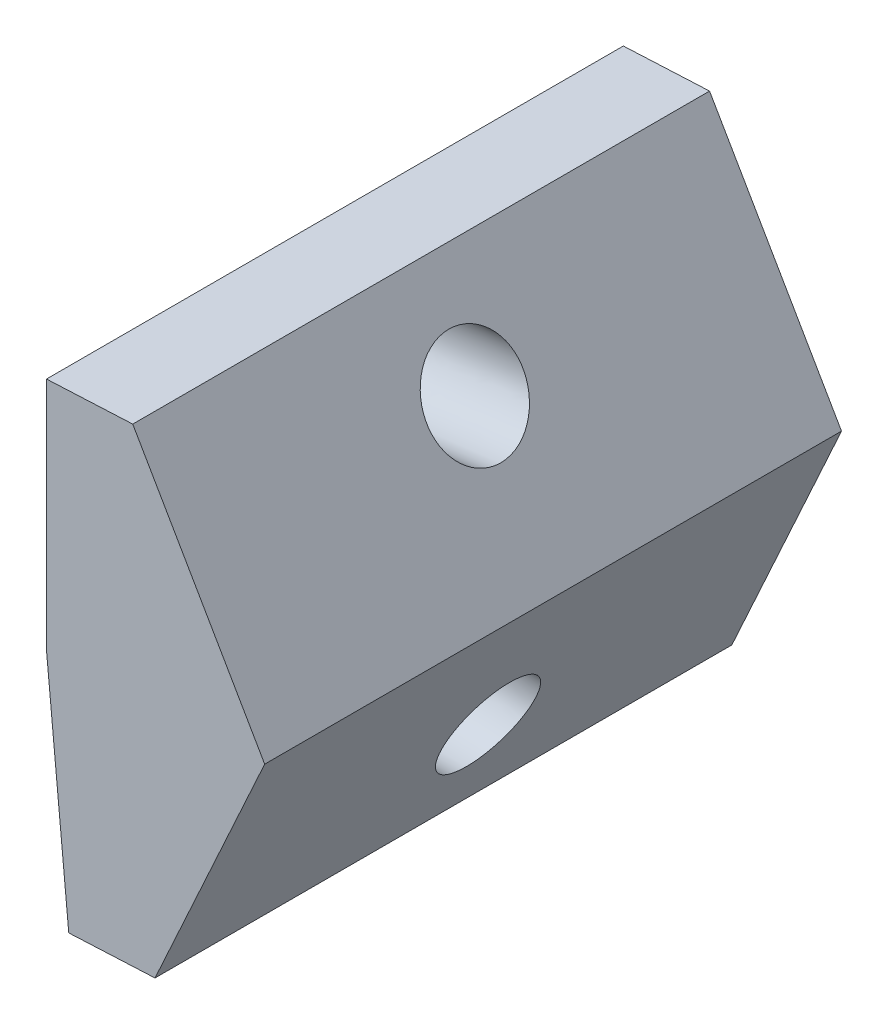
ISO-10303-21;
HEADER;
FILE_DESCRIPTION(('STEP AP214'),'2;1');
FILE_NAME('part.step','',(''),(''),'','','');
FILE_SCHEMA(('AUTOMOTIVE_DESIGN { 1 0 10303 214 1 1 1 1 }'));
ENDSEC;
DATA;
#1=APPLICATION_CONTEXT('core data for automotive mechanical design processes');
#2=APPLICATION_PROTOCOL_DEFINITION('international standard','automotive_design',2000,#1);
#3=PRODUCT_CONTEXT('',#1,'mechanical');
#4=PRODUCT('Part','Part','',(#3));
#5=PRODUCT_RELATED_PRODUCT_CATEGORY('part','',(#4));
#6=PRODUCT_DEFINITION_FORMATION('','',#4);
#7=PRODUCT_DEFINITION_CONTEXT('part definition',#1,'design');
#8=PRODUCT_DEFINITION('design','',#6,#7);
#9=PRODUCT_DEFINITION_SHAPE('','',#8);
#10=(LENGTH_UNIT() NAMED_UNIT(*) SI_UNIT(.MILLI.,.METRE.));
#11=(NAMED_UNIT(*) PLANE_ANGLE_UNIT() SI_UNIT($,.RADIAN.));
#12=(NAMED_UNIT(*) SI_UNIT($,.STERADIAN.) SOLID_ANGLE_UNIT());
#13=UNCERTAINTY_MEASURE_WITH_UNIT(LENGTH_MEASURE(1.E-05),#10,'distance_accuracy_value','');
#14=(GEOMETRIC_REPRESENTATION_CONTEXT(3) GLOBAL_UNCERTAINTY_ASSIGNED_CONTEXT((#13)) GLOBAL_UNIT_ASSIGNED_CONTEXT((#10,
#11,#12)) REPRESENTATION_CONTEXT('',''));
#15=CARTESIAN_POINT('',(0.,0.,0.));
#16=DIRECTION('',(0.,0.,1.));
#17=DIRECTION('',(1.,0.,0.));
#18=AXIS2_PLACEMENT_3D('',#15,#16,#17);
#19=CARTESIAN_POINT('',(-3.5303,-10.0970811615136,7.5));
#20=DIRECTION('',(1.,0.,0.));
#21=DIRECTION('',(0.,1.,0.));
#22=AXIS2_PLACEMENT_3D('',#19,#20,#21);
#23=PLANE('',#22);
#24=DIRECTION('',(0.,-1.,0.));
#25=VECTOR('',#24,1.);
#26=CARTESIAN_POINT('',(-3.5303,-10.0970811615136,-7.5));
#27=LINE('',#26,#25);
#28=CARTESIAN_POINT('',(-3.5303,-3.99106819498268,-7.5));
#29=VERTEX_POINT('',#28);
#30=CARTESIAN_POINT('',(-3.5303,-10.0970811615136,-7.5));
#31=VERTEX_POINT('',#30);
#32=EDGE_CURVE('E143',#29,#31,#27,.T.);
#33=ORIENTED_EDGE('',*,*,#32,.T.);
#34=DIRECTION('',(0.,0.,-1.));
#35=VECTOR('',#34,1.);
#36=CARTESIAN_POINT('',(-3.5303,-10.0970811615136,7.5));
#37=LINE('',#36,#35);
#38=CARTESIAN_POINT('',(-3.5303,-10.0970811615136,7.5));
#39=VERTEX_POINT('',#38);
#40=EDGE_CURVE('E140',#39,#31,#37,.T.);
#41=ORIENTED_EDGE('',*,*,#40,.F.);
#42=DIRECTION('',(0.,-1.,0.));
#43=VECTOR('',#42,1.);
#44=CARTESIAN_POINT('',(-3.5303,-10.0970811615136,7.5));
#45=LINE('',#44,#43);
#46=CARTESIAN_POINT('',(-3.5303,-3.99106819498268,7.5));
#47=VERTEX_POINT('',#46);
#48=EDGE_CURVE('E85',#47,#39,#45,.T.);
#49=ORIENTED_EDGE('',*,*,#48,.F.);
#50=DIRECTION('',(0.,0.,-1.));
#51=VECTOR('',#50,1.);
#52=CARTESIAN_POINT('',(-3.5303,-3.99106819498268,7.5));
#53=LINE('',#52,#51);
#54=EDGE_CURVE('E52',#47,#29,#53,.T.);
#55=ORIENTED_EDGE('',*,*,#54,.T.);
#56=EDGE_LOOP('',(#33,#41,#49,#55));
#57=FACE_BOUND('',#56,.T.);
#58=CARTESIAN_POINT('',(-3.5303,-7.9918073271231,0.));
#59=CARTESIAN_POINT('',(-3.5303,-7.99180394474288,0.0692361131438415));
#60=CARTESIAN_POINT('',(-3.5303,-7.98603376199412,0.138544909012275));
#61=CARTESIAN_POINT('',(-3.5303,-7.96310415475466,0.275212768795426));
#62=CARTESIAN_POINT('',(-3.53029999999999,-7.94594473024024,0.342571832706082));
#63=CARTESIAN_POINT('',(-3.5303,-7.90071388855061,0.473531497229015));
#64=CARTESIAN_POINT('',(-3.53030000000001,-7.8726424773822,0.537132099910216));
#65=CARTESIAN_POINT('',(-3.53030000000001,-7.80636086950595,0.658807459460621));
#66=CARTESIAN_POINT('',(-3.5303,-7.76815068205695,0.716882221376018));
#67=CARTESIAN_POINT('',(-3.53029999999999,-7.68264571859224,0.825907649897007));
#68=CARTESIAN_POINT('',(-3.53029999999999,-7.63535095216627,0.876858324022741));
#69=CARTESIAN_POINT('',(-3.5303,-7.53298122858287,0.970229355897886));
#70=CARTESIAN_POINT('',(-3.53029999999999,-7.4779062798463,1.01264972287993));
#71=CARTESIAN_POINT('',(-3.53029999999999,-7.36149526560176,1.087790404585));
#72=CARTESIAN_POINT('',(-3.5303,-7.30015920629542,1.12051072891578));
#73=CARTESIAN_POINT('',(-3.53029999999999,-7.17291769740442,1.17534881186071));
#74=CARTESIAN_POINT('',(-3.53029999999999,-7.10701225143016,1.19746657885212));
#75=CARTESIAN_POINT('',(-3.5303,-6.97244972088646,1.2304895500749));
#76=CARTESIAN_POINT('',(-3.5303,-6.90379263770161,1.24139475994819));
#77=CARTESIAN_POINT('',(-3.5303,-6.76562046752682,1.25169184641547));
#78=CARTESIAN_POINT('',(-3.53030000000001,-6.69610538067511,1.25108372486434));
#79=CARTESIAN_POINT('',(-3.53030000000001,-6.55813451319878,1.23837092738207));
#80=CARTESIAN_POINT('',(-3.53030000000001,-6.48967873257312,1.22626625146212));
#81=CARTESIAN_POINT('',(-3.53030000000001,-6.35571457978345,1.1908942126054));
#82=CARTESIAN_POINT('',(-3.53030000000001,-6.29020620760946,1.16762684970642));
#83=CARTESIAN_POINT('',(-3.53030000000001,-6.16394367648924,1.11057118936071));
#84=CARTESIAN_POINT('',(-3.5303,-6.10318951751723,1.07678289197105));
#85=CARTESIAN_POINT('',(-3.5303,-5.9881110845989,0.999617296648222));
#86=CARTESIAN_POINT('',(-3.53029999999999,-5.93378681060842,0.956239998780942));
#87=CARTESIAN_POINT('',(-3.53029999999999,-5.83306646933222,0.861092811173564));
#88=CARTESIAN_POINT('',(-3.5303,-5.78667040198655,0.809322921496942));
#89=CARTESIAN_POINT('',(-3.5303,-5.70308612146547,0.698818432336043));
#90=CARTESIAN_POINT('',(-3.5303,-5.66589790822167,0.640083832903495));
#91=CARTESIAN_POINT('',(-3.5303,-5.60175501756303,0.517269895172356));
#92=CARTESIAN_POINT('',(-3.53030000000001,-5.57480034008189,0.453190556908385));
#93=CARTESIAN_POINT('',(-3.53030000000001,-5.53186795045755,0.321454520228471));
#94=CARTESIAN_POINT('',(-3.5303,-5.51589023826147,0.253797821829763));
#95=CARTESIAN_POINT('',(-3.53029999999999,-5.49535245487502,0.116773106148691));
#96=CARTESIAN_POINT('',(-3.53029999999999,-5.49079238365462,0.0474050888708287));
#97=CARTESIAN_POINT('',(-3.5303,-5.49321565174281,-0.0911290259163035));
#98=CARTESIAN_POINT('',(-3.5303,-5.50019899104962,-0.160295123425605));
#99=CARTESIAN_POINT('',(-3.5303,-5.52551647533157,-0.296517728885802));
#100=CARTESIAN_POINT('',(-3.53030000000001,-5.54385062033325,-0.363574236831768));
#101=CARTESIAN_POINT('',(-3.53030000000001,-5.59136404808877,-0.49372817496707));
#102=CARTESIAN_POINT('',(-3.53030000000001,-5.62054333089221,-0.556825605138298));
#103=CARTESIAN_POINT('',(-3.53030000000001,-5.68894224791223,-0.677321089950941));
#104=CARTESIAN_POINT('',(-3.5303,-5.72816188219214,-0.734719144556398));
#105=CARTESIAN_POINT('',(-3.5303,-5.81555979128732,-0.842232769485394));
#106=CARTESIAN_POINT('',(-3.5303,-5.86373806616845,-0.892348339755383));
#107=CARTESIAN_POINT('',(-3.5303,-5.96772445279868,-0.983914740995391));
#108=CARTESIAN_POINT('',(-3.53030000000001,-6.02353256460571,-1.02536557189963));
#109=CARTESIAN_POINT('',(-3.53030000000001,-6.14123937621127,-1.09845921944958));
#110=CARTESIAN_POINT('',(-3.5303,-6.20313807605243,-1.13010203602665));
#111=CARTESIAN_POINT('',(-3.5303,-6.33131882283796,-1.18270689590419));
#112=CARTESIAN_POINT('',(-3.5303,-6.39760086980704,-1.20366893914443));
#113=CARTESIAN_POINT('',(-3.53029999999999,-6.53272016616868,-1.23433408408164));
#114=CARTESIAN_POINT('',(-3.53029999999999,-6.60155741557058,-1.2440371857374));
#115=CARTESIAN_POINT('',(-3.5303,-6.73988849251748,-1.25191681931931));
#116=CARTESIAN_POINT('',(-3.5303,-6.80938232006331,-1.25009335123069));
#117=CARTESIAN_POINT('',(-3.5303,-6.94710981905069,-1.23497013917212));
#118=CARTESIAN_POINT('',(-3.5303,-7.0153434904938,-1.22167039521637));
#119=CARTESIAN_POINT('',(-3.53029999999999,-7.14866870039823,-1.18396146308635));
#120=CARTESIAN_POINT('',(-3.53029999999999,-7.21376023887092,-1.15955227495232));
#121=CARTESIAN_POINT('',(-3.53029999999999,-7.33900587920801,-1.10029769267066));
#122=CARTESIAN_POINT('',(-3.53029999999999,-7.39915998110008,-1.06545229858158));
#123=CARTESIAN_POINT('',(-3.5303,-7.51287161335104,-0.986286422007295));
#124=CARTESIAN_POINT('',(-3.5303,-7.56642914375599,-0.941965939588243));
#125=CARTESIAN_POINT('',(-3.5303,-7.66547051224383,-0.84507220583463));
#126=CARTESIAN_POINT('',(-3.5303,-7.710954350388,-0.792498954562694));
#127=CARTESIAN_POINT('',(-3.53029999999999,-7.79259365136215,-0.6805501066953));
#128=CARTESIAN_POINT('',(-3.53029999999999,-7.82874911426083,-0.621174510149938));
#129=CARTESIAN_POINT('',(-3.5303,-7.89073520009994,-0.497257186717971));
#130=CARTESIAN_POINT('',(-3.5303,-7.91656582310576,-0.432715459864088));
#131=CARTESIAN_POINT('',(-3.5303,-7.95485305428998,-0.307862479443491));
#132=CARTESIAN_POINT('',(-3.5303,-7.96850543917982,-0.247917394010153));
#133=CARTESIAN_POINT('',(-3.5303,-7.98237526806179,-0.156429210434266));
#134=CARTESIAN_POINT('',(-3.5303,-7.98589788710458,-0.125357540837874));
#135=CARTESIAN_POINT('',(-3.5303,-7.99062133412572,-0.0628629049591802));
#136=CARTESIAN_POINT('',(-3.5303,-7.99180886300465,-0.0314389457567166));
#137=CARTESIAN_POINT('',(-3.5303,-7.9918073271231,0.));
#138=B_SPLINE_CURVE_WITH_KNOTS('',3,(#58,#59,#60,#61,#62,#63,#64,#65,#66,#67,#68,#69,#70,#71,
#72,#73,#74,#75,#76,#77,#78,#79,#80,#81,#82,#83,#84,#85,#86,#87,#88,#89,#90,#91,#92,#93,#94,#95,
#96,#97,#98,#99,#100,#101,#102,#103,#104,#105,#106,#107,#108,#109,#110,#111,#112,#113,#114,#115,
#116,#117,#118,#119,#120,#121,#122,#123,#124,#125,#126,#127,#128,#129,#130,#131,#132,#133,#134,
#135,#136,#137),.UNSPECIFIED.,.T.,.F.,(4,2,2,2,2,2,2,2,2,2,2,2,2,2,2,2,2,2,2,2,2,2,2,2,2,2,2,2,
2,2,2,2,2,2,2,2,2,2,2,4),(0.,0.207595797918636,0.415191596269628,0.622787280344089,
0.830382774840533,1.03797805019884,1.24557310086877,1.45316794591798,1.66076262694274,
1.86835720351039,2.07595174663294,2.28354628955317,2.49114083177063,2.69873537286185,
2.90632991252679,3.11392445062165,3.32151898717466,3.529113522383,3.73670805659115,
3.94430259025319,4.15189712388303,4.35949165799809,4.56708619306266,4.77468072943697,
4.98227526733777,5.18986980681455,5.39746434774416,5.60505888984422,5.81265343270415,
6.02024797583011,6.22784251869907,6.43543706081622,6.64303160176907,6.85062614127274,
7.0582206792011,7.26581521560063,7.47340975068532,7.657148364809,7.75088178520914,
7.84514751928525),.UNSPECIFIED.);
#139=CARTESIAN_POINT('',(-3.5303,-7.9918073271231,0.));
#140=VERTEX_POINT('',#139);
#141=EDGE_CURVE('E158',#140,#140,#138,.T.);
#142=ORIENTED_EDGE('',*,*,#141,.F.);
#143=EDGE_LOOP('',(#142));
#144=FACE_BOUND('',#143,.T.);
#145=ADVANCED_FACE('F38',(#57,#144),#23,.F.);
#146=CARTESIAN_POINT('',(-1.28768671203867,-3.88432015647812,7.5));
#147=DIRECTION('',(-0.866025403784439,-0.5,0.));
#148=DIRECTION('',(0.5,-0.866025403784439,0.));
#149=AXIS2_PLACEMENT_3D('',#146,#147,#148);
#150=PLANE('',#149);
#151=DIRECTION('',(-0.5,0.866025403784439,0.));
#152=VECTOR('',#151,1.);
#153=CARTESIAN_POINT('',(-1.28768671203867,-3.88432015647812,-7.5));
#154=LINE('',#153,#152);
#155=CARTESIAN_POINT('',(2.14350896906507,-9.8273254068607,-7.5));
#156=VERTEX_POINT('',#155);
#157=CARTESIAN_POINT('',(-1.28768671203867,-3.88432015647812,-7.5));
#158=VERTEX_POINT('',#157);
#159=EDGE_CURVE('E75',#156,#158,#154,.T.);
#160=ORIENTED_EDGE('',*,*,#159,.T.);
#161=DIRECTION('',(0.,0.,-1.));
#162=VECTOR('',#161,1.);
#163=CARTESIAN_POINT('',(-1.28768671203867,-3.88432015647812,7.5));
#164=LINE('',#163,#162);
#165=CARTESIAN_POINT('',(-1.28768671203867,-3.88432015647812,7.5));
#166=VERTEX_POINT('',#165);
#167=EDGE_CURVE('E11',#166,#158,#164,.T.);
#168=ORIENTED_EDGE('',*,*,#167,.F.);
#169=DIRECTION('',(-0.5,0.866025403784439,0.));
#170=VECTOR('',#169,1.);
#171=CARTESIAN_POINT('',(-1.28768671203867,-3.88432015647812,7.5));
#172=LINE('',#171,#170);
#173=CARTESIAN_POINT('',(2.14350896906507,-9.8273254068607,7.5));
#174=VERTEX_POINT('',#173);
#175=EDGE_CURVE('E145',#174,#166,#172,.T.);
#176=ORIENTED_EDGE('',*,*,#175,.F.);
#177=DIRECTION('',(0.,0.,-1.));
#178=VECTOR('',#177,1.);
#179=CARTESIAN_POINT('',(2.14350896906507,-9.82732540686069,7.5));
#180=LINE('',#179,#178);
#181=EDGE_CURVE('E123',#174,#156,#180,.T.);
#182=ORIENTED_EDGE('',*,*,#181,.T.);
#183=EDGE_LOOP('',(#160,#168,#176,#182));
#184=FACE_BOUND('',#183,.T.);
#185=CARTESIAN_POINT('',(0.782993284981045,-7.47084311753284,0.));
#186=CARTESIAN_POINT('',(0.782994603728125,-7.47084540166978,-0.0326199650851086));
#187=CARTESIAN_POINT('',(0.782305577825765,-7.46965197379917,-0.0652247081088988));
#188=CARTESIAN_POINT('',(0.778202295343216,-7.46254488006152,-0.162057682197411));
#189=CARTESIAN_POINT('',(0.772780562959937,-7.45315416410847,-0.225998730510113));
#190=CARTESIAN_POINT('',(0.756645907571885,-7.42520812121419,-0.352025224886616));
#191=CARTESIAN_POINT('',(0.745862010010541,-7.40652986273494,-0.414073596224739));
#192=CARTESIAN_POINT('',(0.719371180939568,-7.36064640084774,-0.533844220943199));
#193=CARTESIAN_POINT('',(0.703663851822228,-7.33344050876304,-0.59156612445889));
#194=CARTESIAN_POINT('',(0.676703484226493,-7.28674378229783,-0.674258069105703));
#195=CARTESIAN_POINT('',(0.667056511665118,-7.27003473568358,-0.701379686192105));
#196=CARTESIAN_POINT('',(0.646721389905066,-7.23481327161802,-0.754002035348226));
#197=CARTESIAN_POINT('',(0.636033550186092,-7.21630139020129,-0.779503245507601));
#198=CARTESIAN_POINT('',(0.602274606711313,-7.15782918489262,-0.853939602982759));
#199=CARTESIAN_POINT('',(0.577705680216088,-7.11527455591573,-0.90020501652559));
#200=CARTESIAN_POINT('',(0.52533288398341,-7.02456221190644,-0.984753825498199));
#201=CARTESIAN_POINT('',(0.497526722437654,-6.97640052734562,-1.02303151180288));
#202=CARTESIAN_POINT('',(0.452650459230374,-6.89867255941677,-1.0755242638794));
#203=CARTESIAN_POINT('',(0.436446973547148,-6.87060729895373,-1.09276711347507));
#204=CARTESIAN_POINT('',(0.403426187747903,-6.81341362024361,-1.12462489825201));
#205=CARTESIAN_POINT('',(0.386609473604173,-6.7842862169303,-1.13924226695654));
#206=CARTESIAN_POINT('',(0.335377803814663,-6.69555036189826,-1.17909460148479));
#207=CARTESIAN_POINT('',(0.300165844644871,-6.63456145958215,-1.20034776841016));
#208=CARTESIAN_POINT('',(0.228560188326857,-6.51053682473004,-1.23188780621603));
#209=CARTESIAN_POINT('',(0.192166613910322,-6.44750130477156,-1.24217581229175));
#210=CARTESIAN_POINT('',(0.119018215208786,-6.3208045617282,-1.25168758061786));
#211=CARTESIAN_POINT('',(0.0822634049723828,-6.25714336297619,-1.2509117714561));
#212=CARTESIAN_POINT('',(0.00922953394679882,-6.13064498768645,-1.2383006346357));
#213=CARTESIAN_POINT('',(-0.0270495143440176,-6.06780783279652,-1.22646501702143));
#214=CARTESIAN_POINT('',(-0.0982908308533141,-5.94441425300432,-1.19187310122451));
#215=CARTESIAN_POINT('',(-0.133252978825155,-5.88385803637535,-1.16911580837426));
#216=CARTESIAN_POINT('',(-0.200990247126837,-5.76653364611091,-1.11297502639819));
#217=CARTESIAN_POINT('',(-0.233765027546105,-5.70976606121783,-1.07958989036576));
#218=CARTESIAN_POINT('',(-0.296223254734854,-5.60158523837628,-1.00270078448738));
#219=CARTESIAN_POINT('',(-0.325906035191574,-5.55017315451536,-0.959194640111474));
#220=CARTESIAN_POINT('',(-0.380503674446827,-5.45560726935199,-0.864157295239624));
#221=CARTESIAN_POINT('',(-0.405524199625353,-5.41227044851074,-0.812869832515346));
#222=CARTESIAN_POINT('',(-0.450075148395671,-5.33510594171514,-0.704570776314989));
#223=CARTESIAN_POINT('',(-0.469770487504918,-5.30099261370561,-0.64783095105594));
#224=CARTESIAN_POINT('',(-0.503586948182649,-5.24242078567961,-0.53031726161562));
#225=CARTESIAN_POINT('',(-0.517860790669727,-5.21769776527276,-0.469720986396382));
#226=CARTESIAN_POINT('',(-0.535168461024686,-5.18772000085725,-0.376668827222215));
#227=CARTESIAN_POINT('',(-0.540217944983776,-5.17897403808806,-0.345664145599708));
#228=CARTESIAN_POINT('',(-0.549018800035685,-5.1637305099881,-0.282893433258612));
#229=CARTESIAN_POINT('',(-0.552768911374791,-5.15723512661476,-0.25112669543798));
#230=CARTESIAN_POINT('',(-0.562003751955704,-5.14123991352885,-0.154987644628149));
#231=CARTESIAN_POINT('',(-0.565469864041615,-5.13523643129128,-0.08979325398794));
#232=CARTESIAN_POINT('',(-0.566850559205849,-5.13284499711703,0.0408174058216849));
#233=CARTESIAN_POINT('',(-0.564766387556744,-5.13645488830498,0.106233621932971));
#234=CARTESIAN_POINT('',(-0.557596168074085,-5.14887407275037,0.202595816844328));
#235=CARTESIAN_POINT('',(-0.554568040700432,-5.15411894321332,0.234201569167408));
#236=CARTESIAN_POINT('',(-0.547223789896921,-5.16683955874855,0.296804258303693));
#237=CARTESIAN_POINT('',(-0.542907846633159,-5.174314991764,0.327801279632581));
#238=CARTESIAN_POINT('',(-0.527954172259974,-5.20021551553809,0.420362200706408));
#239=CARTESIAN_POINT('',(-0.515369596684134,-5.22201263982682,0.48070984184095));
#240=CARTESIAN_POINT('',(-0.485509960674004,-5.27373104649265,0.596576485601838));
#241=CARTESIAN_POINT('',(-0.468232836906829,-5.30365590266714,0.65209334990343));
#242=CARTESIAN_POINT('',(-0.438955584348343,-5.35436559160383,0.731598130095721));
#243=CARTESIAN_POINT('',(-0.428450288488788,-5.37256129778051,0.757837738009428));
#244=CARTESIAN_POINT('',(-0.406439519364597,-5.41068506821682,0.808565847929065));
#245=CARTESIAN_POINT('',(-0.394934378088208,-5.43061255745594,0.833054926295004));
#246=CARTESIAN_POINT('',(-0.358774070760916,-5.49324404696435,0.904251011304654));
#247=CARTESIAN_POINT('',(-0.332689581748198,-5.53842370722372,0.948104912269175));
#248=CARTESIAN_POINT('',(-0.277493569451835,-5.63402600489615,1.02742387394583));
#249=CARTESIAN_POINT('',(-0.248379906871614,-5.68445234767957,1.06288294728443));
#250=CARTESIAN_POINT('',(-0.201612595450298,-5.76545570719469,1.11080657251683));
#251=CARTESIAN_POINT('',(-0.184744806828807,-5.79467157409843,1.1264093697253));
#252=CARTESIAN_POINT('',(-0.150461582286419,-5.85405186085311,1.15488235607723));
#253=CARTESIAN_POINT('',(-0.133046668440363,-5.88421537644391,1.16775506452392));
#254=CARTESIAN_POINT('',(-0.0801220351767863,-5.97588353022837,1.20222564638293));
#255=CARTESIAN_POINT('',(-0.0439166291570518,-6.03859313296322,1.21969204471621));
#256=CARTESIAN_POINT('',(0.0293811032947469,-6.16554852964933,1.24332077723044));
#257=CARTESIAN_POINT('',(0.0664733562564787,-6.22979419634625,1.24948404454832));
#258=CARTESIAN_POINT('',(0.140698691312351,-6.35835624787185,1.2504535766739));
#259=CARTESIAN_POINT('',(0.177831772815253,-6.42267263167647,1.24526000383058));
#260=CARTESIAN_POINT('',(0.251267741264216,-6.54986746013311,1.2235717799102));
#261=CARTESIAN_POINT('',(0.287570583260928,-6.61274582693056,1.20707651844695));
#262=CARTESIAN_POINT('',(0.358462988846614,-6.73553507527573,1.16298988240366));
#263=CARTESIAN_POINT('',(0.393052342807005,-6.7954455937361,1.13539715390351));
#264=CARTESIAN_POINT('',(0.459599740603662,-6.91070906783138,1.06950414937231));
#265=CARTESIAN_POINT('',(0.491557288159761,-6.96606116388384,1.03120185979536));
#266=CARTESIAN_POINT('',(0.551344195478364,-7.06961512498703,0.945316539620827));
#267=CARTESIAN_POINT('',(0.579236590788916,-7.11792617080968,0.897909701932721));
#268=CARTESIAN_POINT('',(0.629673835184851,-7.20528604069718,0.796287866200296));
#269=CARTESIAN_POINT('',(0.652379399330665,-7.24461323141224,0.742392952894845));
#270=CARTESIAN_POINT('',(0.692244408114707,-7.31366145207039,0.62965942062893));
#271=CARTESIAN_POINT('',(0.709565885979021,-7.34366313179357,0.571050572934453));
#272=CARTESIAN_POINT('',(0.738633960555028,-7.39401051383745,0.450503437143994));
#273=CARTESIAN_POINT('',(0.750521189686829,-7.41459979865496,0.388701631356487));
#274=CARTESIAN_POINT('',(0.767341354213596,-7.44373317820703,0.273120278186633));
#275=CARTESIAN_POINT('',(0.773127365334172,-7.45375484344105,0.219830104104131));
#276=CARTESIAN_POINT('',(0.780990987152139,-7.46737503596129,0.111027371076517));
#277=CARTESIAN_POINT('',(0.782991041586117,-7.47083923185884,0.0554916597268455));
#278=CARTESIAN_POINT('',(0.782993284981045,-7.47084311753284,0.));
#279=B_SPLINE_CURVE_WITH_KNOTS('',3,(#185,#186,#187,#188,#189,#190,#191,#192,#193,#194,#195,
#196,#197,#198,#199,#200,#201,#202,#203,#204,#205,#206,#207,#208,#209,#210,#211,#212,#213,#214,
#215,#216,#217,#218,#219,#220,#221,#222,#223,#224,#225,#226,#227,#228,#229,#230,#231,#232,#233,
#234,#235,#236,#237,#238,#239,#240,#241,#242,#243,#244,#245,#246,#247,#248,#249,#250,#251,#252,
#253,#254,#255,#256,#257,#258,#259,#260,#261,#262,#263,#264,#265,#266,#267,#268,#269,#270,#271,
#272,#273,#274,#275,#276,#277,#278),.UNSPECIFIED.,.T.,.F.,(4,2,2,2,2,2,2,2,2,2,2,2,2,2,2,2,2,2,
2,2,2,2,2,2,2,2,2,2,2,2,2,2,2,2,2,2,2,2,2,2,2,2,2,2,2,2,4),(0.,0.0978182065282662,
0.291390887351535,0.48759680270677,0.68381856739241,0.783581352210525,0.883314564725101,
1.08491812243667,1.28666528386183,1.39668743455031,1.5066070749181,1.72634016045096,
1.94605049536599,2.16575231920951,2.38545990314983,2.60518750027409,2.82494916330601,
3.04475808648978,3.25873097766259,3.46501832700273,3.66496532346726,3.76269218941401,
3.86051353907185,4.05620921788671,4.25186099373367,4.34830833105014,4.44474218165658,
4.63996532354869,4.83527444522359,4.93602617146116,5.03674457103026,5.24032975937294,
5.44405971458774,5.55546094223276,5.66675891810157,5.88924972102062,6.11172215524813,
6.33419140919527,6.55667267929926,6.77918110094004,7.00173138541062,7.22034411858753,
7.43079871507118,7.63411295195028,7.83181745419613,7.99491512449878,8.16131918463799),.UNSPECIFIED.);
#280=CARTESIAN_POINT('',(0.782993284981045,-7.47084311753284,0.));
#281=VERTEX_POINT('',#280);
#282=EDGE_CURVE('E42',#281,#281,#279,.T.);
#283=ORIENTED_EDGE('',*,*,#282,.F.);
#284=EDGE_LOOP('',(#283));
#285=FACE_BOUND('',#284,.T.);
#286=ADVANCED_FACE('F184',(#184,#285),#150,.F.);
#287=CARTESIAN_POINT('',(-3.5303,-10.0970811615136,7.5));
#288=DIRECTION('',(0.99548932614519,0.0948736081900296,0.));
#289=DIRECTION('',(0.0948736081900297,-0.99548932614519,0.));
#290=AXIS2_PLACEMENT_3D('',#287,#288,#289);
#291=PLANE('',#290);
#292=DIRECTION('',(-0.0948736081900297,0.99548932614519,0.));
#293=VECTOR('',#292,1.);
#294=CARTESIAN_POINT('',(-3.5303,-10.0970811615136,-7.5));
#295=LINE('',#294,#293);
#296=CARTESIAN_POINT('',(-2.9510005182101,-16.1755518949993,-7.5));
#297=VERTEX_POINT('',#296);
#298=EDGE_CURVE('E131',#297,#31,#295,.T.);
#299=ORIENTED_EDGE('',*,*,#298,.F.);
#300=DIRECTION('',(0.,0.,-1.));
#301=VECTOR('',#300,1.);
#302=CARTESIAN_POINT('',(-2.9510005182101,-16.1755518949993,7.5));
#303=LINE('',#302,#301);
#304=CARTESIAN_POINT('',(-2.9510005182101,-16.1755518949993,7.5));
#305=VERTEX_POINT('',#304);
#306=EDGE_CURVE('E114',#305,#297,#303,.T.);
#307=ORIENTED_EDGE('',*,*,#306,.F.);
#308=DIRECTION('',(-0.0948736081900297,0.99548932614519,0.));
#309=VECTOR('',#308,1.);
#310=CARTESIAN_POINT('',(-3.5303,-10.0970811615136,7.5));
#311=LINE('',#310,#309);
#312=EDGE_CURVE('E110',#305,#39,#311,.T.);
#313=ORIENTED_EDGE('',*,*,#312,.T.);
#314=ORIENTED_EDGE('',*,*,#40,.T.);
#315=EDGE_LOOP('',(#299,#307,#313,#314));
#316=FACE_BOUND('',#315,.T.);
#317=CARTESIAN_POINT('',(-3.09333569065956,-14.682058102451,0.));
#318=CARTESIAN_POINT('',(-3.09333601156053,-14.6820547353029,0.0692358626819155));
#319=CARTESIAN_POINT('',(-3.09388344831273,-14.6763105936607,0.138544405837958));
#320=CARTESIAN_POINT('',(-3.09605885706792,-14.6534844754482,0.275211754098851));
#321=CARTESIAN_POINT('',(-3.09768682891376,-14.6364025005267,0.342570559487269));
#322=CARTESIAN_POINT('',(-3.10197802940154,-14.5913758133011,0.473529755417847));
#323=CARTESIAN_POINT('',(-3.10464125803812,-14.5634311010531,0.537130145979475));
#324=CARTESIAN_POINT('',(-3.11092961648702,-14.4974486446642,0.658805162167846));
#325=CARTESIAN_POINT('',(-3.11455474629231,-14.4594109005971,0.716879787835021));
#326=CARTESIAN_POINT('',(-3.12266689332165,-14.3742918044239,0.825905040356856));
#327=CARTESIAN_POINT('',(-3.12715391053823,-14.3272104523962,0.876855667273156));
#328=CARTESIAN_POINT('',(-3.13686608129316,-14.2253026351994,0.970226708469673));
#329=CARTESIAN_POINT('',(-3.14209123482483,-14.1704761701004,1.012647122827));
#330=CARTESIAN_POINT('',(-3.15313555986085,-14.0545903310606,1.08778800206828));
#331=CARTESIAN_POINT('',(-3.15895473136018,-13.9935309571724,1.12050846703407));
#332=CARTESIAN_POINT('',(-3.17102659345021,-13.8668633824212,1.17534692644399));
#333=CARTESIAN_POINT('',(-3.1772792840379,-13.8012551815897,1.19746492096137));
#334=CARTESIAN_POINT('',(-3.19004572848692,-13.6672994965023,1.23048843042266));
#335=CARTESIAN_POINT('',(-3.19655948234703,-13.5989520122589,1.24139394541842));
#336=CARTESIAN_POINT('',(-3.20966839775232,-13.4614028496176,1.25169171124794));
#337=CARTESIAN_POINT('',(-3.21626355929734,-13.3922011712212,1.25108396210281));
#338=CARTESIAN_POINT('',(-3.22935338928063,-13.2548522680013,1.23837196303159));
#339=CARTESIAN_POINT('',(-3.23584805771878,-13.186705043179,1.22626771309218));
#340=CARTESIAN_POINT('',(-3.24855777222996,-13.0533446137022,1.19089655368163));
#341=CARTESIAN_POINT('',(-3.25477281830187,-12.9881314090595,1.16762964416558));
#342=CARTESIAN_POINT('',(-3.26675187062227,-12.8624376681994,1.11057488097867));
#343=CARTESIAN_POINT('',(-3.27251587686786,-12.8019571320126,1.07678702723998));
#344=CARTESIAN_POINT('',(-3.28343387158746,-12.6873968510912,0.999622268521556));
#345=CARTESIAN_POINT('',(-3.28858786005649,-12.6333171064089,0.956245363463531));
#346=CARTESIAN_POINT('',(-3.2981436655632,-12.5330499977143,0.861098873798067));
#347=CARTESIAN_POINT('',(-3.3025454825941,-12.486862633773,0.809329289115187));
#348=CARTESIAN_POINT('',(-3.31047553677289,-12.4036542005603,0.69882529671446));
#349=CARTESIAN_POINT('',(-3.31400377391305,-12.3666331313698,0.640090888935133));
#350=CARTESIAN_POINT('',(-3.32008935394573,-12.3027783873423,0.517277211959698));
#351=CARTESIAN_POINT('',(-3.32264669683077,-12.2759447125836,0.453197942722443));
#352=CARTESIAN_POINT('',(-3.32671995234869,-12.2332048772585,0.321461933665314));
#353=CARTESIAN_POINT('',(-3.3282358650404,-12.2172987160747,0.253805194047545));
#354=CARTESIAN_POINT('',(-3.33018444847091,-12.1968526295056,0.11678033041733));
#355=CARTESIAN_POINT('',(-3.33061711961999,-12.1923126998153,0.0474122070530795));
#356=CARTESIAN_POINT('',(-3.33038728731025,-12.1947242831366,-0.091122181660064));
#357=CARTESIAN_POINT('',(-3.32972478385123,-12.2016757961503,-0.16028844700892));
#358=CARTESIAN_POINT('',(-3.32732287536089,-12.2268785296622,-0.29651142012775));
#359=CARTESIAN_POINT('',(-3.32558347033255,-12.245129750129,-0.363568127903585));
#360=CARTESIAN_POINT('',(-3.32107573453845,-12.2924284979443,-0.493722474367878));
#361=CARTESIAN_POINT('',(-3.31830740377828,-12.3214760252342,-0.556820113077859));
#362=CARTESIAN_POINT('',(-3.3118181716671,-12.3895662077917,-0.677316012191558));
#363=CARTESIAN_POINT('',(-3.30809727032324,-12.4286088629843,-0.734714272638013));
#364=CARTESIAN_POINT('',(-3.29980552519514,-12.5156124451988,-0.842228309051985));
#365=CARTESIAN_POINT('',(-3.29523468141832,-12.5635733721426,-0.892344085083146));
#366=CARTESIAN_POINT('',(-3.2853691216263,-12.6670906690681,-0.983910912570454));
#367=CARTESIAN_POINT('',(-3.28007440561763,-12.7226470389812,-1.02536196410478));
#368=CARTESIAN_POINT('',(-3.26890713618565,-12.8398229083702,-1.0984560898284));
#369=CARTESIAN_POINT('',(-3.26303458276714,-12.9014424077957,-1.13009916409926));
#370=CARTESIAN_POINT('',(-3.25087361003155,-13.0290450022872,-1.18270459852465));
#371=CARTESIAN_POINT('',(-3.24458519071725,-13.0950280973241,-1.20366695875074));
#372=CARTESIAN_POINT('',(-3.23176592709001,-13.2295380032233,-1.2343328115842));
#373=CARTESIAN_POINT('',(-3.22523508277812,-13.2980648140745,-1.24403630424055));
#374=CARTESIAN_POINT('',(-3.21211109596942,-13.4357721178629,-1.25191679504579));
#375=CARTESIAN_POINT('',(-3.20551795347272,-13.5049526107991,-1.25009379321224));
#376=CARTESIAN_POINT('',(-3.19245121520518,-13.6420592173783,-1.23497157381142));
#377=CARTESIAN_POINT('',(-3.18597761943453,-13.7099853310195,-1.22167235622728));
#378=CARTESIAN_POINT('',(-3.17332852264906,-13.8427097111243,-1.1839645064842));
#379=CARTESIAN_POINT('',(-3.16715302163552,-13.9075079775744,-1.15955587427745));
#380=CARTESIAN_POINT('',(-3.15527044068063,-14.032189464168,-1.10030239222835));
#381=CARTESIAN_POINT('',(-3.14956336074242,-14.0920726842788,-1.06545754231644));
#382=CARTESIAN_POINT('',(-3.13877503106642,-14.2052724164727,-0.986292697665731));
#383=CARTESIAN_POINT('',(-3.13369378133384,-14.2585889285014,-0.941972702848319));
#384=CARTESIAN_POINT('',(-3.12429725446649,-14.3571847590778,-0.845079848038749));
#385=CARTESIAN_POINT('',(-3.11998197733864,-14.4024640775531,-0.792506987972159));
#386=CARTESIAN_POINT('',(-3.11223643581221,-14.4837364573211,-0.680558797629204));
#387=CARTESIAN_POINT('',(-3.10880617142138,-14.5197295185324,-0.621183467293297));
#388=CARTESIAN_POINT('',(-3.10292519798767,-14.5814373674516,-0.497266542456644));
#389=CARTESIAN_POINT('',(-3.10047448895216,-14.6071521550821,-0.432724947917006));
#390=CARTESIAN_POINT('',(-3.0968418821197,-14.6452683540628,-0.307870659100845));
#391=CARTESIAN_POINT('',(-3.09554655618013,-14.6588599436661,-0.247924083108679));
#392=CARTESIAN_POINT('',(-3.09423059799337,-14.6726680232108,-0.156433524947272));
#393=CARTESIAN_POINT('',(-3.09389637439326,-14.6761749629469,-0.125361012415925));
#394=CARTESIAN_POINT('',(-3.09344821692074,-14.680877387455,-0.0628646576544132));
#395=CARTESIAN_POINT('',(-3.09333554493927,-14.6820596314641,-0.0314398223443836));
#396=CARTESIAN_POINT('',(-3.09333569065956,-14.682058102451,0.));
#397=B_SPLINE_CURVE_WITH_KNOTS('',3,(#317,#318,#319,#320,#321,#322,#323,#324,#325,#326,#327,
#328,#329,#330,#331,#332,#333,#334,#335,#336,#337,#338,#339,#340,#341,#342,#343,#344,#345,#346,
#347,#348,#349,#350,#351,#352,#353,#354,#355,#356,#357,#358,#359,#360,#361,#362,#363,#364,#365,
#366,#367,#368,#369,#370,#371,#372,#373,#374,#375,#376,#377,#378,#379,#380,#381,#382,#383,#384,
#385,#386,#387,#388,#389,#390,#391,#392,#393,#394,#395,#396),.UNSPECIFIED.,.T.,.F.,(4,2,2,2,2,2,
2,2,2,2,2,2,2,2,2,2,2,2,2,2,2,2,2,2,2,2,2,2,2,2,2,2,2,2,2,2,2,2,2,4),(0.,0.207595043011116,
0.415190055829751,0.622785067573066,0.830380077797412,1.03797508622557,1.24557009277712,
1.45316509757725,1.66076010094304,1.8683551033487,2.07595010537368,2.28354510763908,
2.49114011073969,2.69873511517879,2.90633012131301,3.11392512931328,3.32152013914604,
3.52911515057698,3.73671015028007,3.94430507135664,4.15189999247149,4.35949491300967,
4.56708983241935,4.7746847502724,4.98227966631121,5.18987458047695,5.39746949291603,
5.60506440396403,5.81265931410892,6.02025422393763,6.22784913407173,6.43544404509933,
6.64303895751065,6.85063387164431,7.05822878765021,7.26582370547315,7.47341862485881,
7.65716205990829,7.75089805762189,7.84516641825208),.UNSPECIFIED.);
#398=CARTESIAN_POINT('',(-3.09333569065956,-14.682058102451,0.));
#399=VERTEX_POINT('',#398);
#400=EDGE_CURVE('E135',#399,#399,#397,.T.);
#401=ORIENTED_EDGE('',*,*,#400,.F.);
#402=EDGE_LOOP('',(#401));
#403=FACE_BOUND('',#402,.T.);
#404=ADVANCED_FACE('F180',(#316,#403),#291,.F.);
#405=CARTESIAN_POINT('',(-0.708375355793089,-16.0690536135137,7.5));
#406=DIRECTION('',(-0.909555849733002,0.415581708231337,0.));
#407=DIRECTION('',(0.415581708231337,0.909555849733002,0.));
#408=AXIS2_PLACEMENT_3D('',#405,#406,#407);
#409=PLANE('',#408);
#410=DIRECTION('',(-0.415581708231337,-0.909555849733002,0.));
#411=VECTOR('',#410,1.);
#412=CARTESIAN_POINT('',(-0.708375355793089,-16.0690536135137,-7.5));
#413=LINE('',#412,#411);
#414=CARTESIAN_POINT('',(-0.708375355793089,-16.0690536135137,-7.5));
#415=VERTEX_POINT('',#414);
#416=EDGE_CURVE('E134',#156,#415,#413,.T.);
#417=ORIENTED_EDGE('',*,*,#416,.F.);
#418=ORIENTED_EDGE('',*,*,#181,.F.);
#419=DIRECTION('',(-0.415581708231337,-0.909555849733002,0.));
#420=VECTOR('',#419,1.);
#421=CARTESIAN_POINT('',(-0.708375355793089,-16.0690536135137,7.5));
#422=LINE('',#421,#420);
#423=CARTESIAN_POINT('',(-0.708375355793089,-16.0690536135137,7.5));
#424=VERTEX_POINT('',#423);
#425=EDGE_CURVE('E107',#174,#424,#422,.T.);
#426=ORIENTED_EDGE('',*,*,#425,.T.);
#427=DIRECTION('',(0.,0.,-1.));
#428=VECTOR('',#427,1.);
#429=CARTESIAN_POINT('',(-0.708375355793089,-16.0690536135137,7.5));
#430=LINE('',#429,#428);
#431=EDGE_CURVE('E117',#424,#415,#430,.T.);
#432=ORIENTED_EDGE('',*,*,#431,.T.);
#433=EDGE_LOOP('',(#417,#418,#426,#432));
#434=FACE_BOUND('',#433,.T.);
#435=CARTESIAN_POINT('',(-0.109026581124109,-14.7572990939259,0.));
#436=CARTESIAN_POINT('',(-0.10902763631684,-14.7573014033556,-0.0326198839279647));
#437=CARTESIAN_POINT('',(-0.108454967434351,-14.7560480413291,-0.0652250254029698));
#438=CARTESIAN_POINT('',(-0.105044493726134,-14.7485837659525,-0.162059018871274));
#439=CARTESIAN_POINT('',(-0.100538098425395,-14.7387209203895,-0.226000428305307));
#440=CARTESIAN_POINT('',(-0.0871273384793212,-14.7093696883297,-0.352028874737879));
#441=CARTESIAN_POINT('',(-0.0781639087289738,-14.6897520299937,-0.414078793166514));
#442=CARTESIAN_POINT('',(-0.0561453878321594,-14.6415615680741,-0.533850256360186));
#443=CARTESIAN_POINT('',(-0.043090101375982,-14.6129883370293,-0.591571594353365));
#444=CARTESIAN_POINT('',(-0.0206817085524039,-14.5639445885403,-0.674263087564595));
#445=CARTESIAN_POINT('',(-0.0126634686308033,-14.5463956038757,-0.701384754784558));
#446=CARTESIAN_POINT('',(0.00423844430831032,-14.5094035190932,-0.754007322168886));
#447=CARTESIAN_POINT('',(0.01312186436099,-14.4899609726224,-0.779508692500256));
#448=CARTESIAN_POINT('',(0.0411812852314393,-14.4285491975428,-0.853945396736069));
#449=CARTESIAN_POINT('',(0.0616022343698498,-14.3838552339301,-0.900210961945599));
#450=CARTESIAN_POINT('',(0.105132917205157,-14.288582544032,-0.984759889863746));
#451=CARTESIAN_POINT('',(0.12824455369023,-14.2379996532416,-1.0230375496456));
#452=CARTESIAN_POINT('',(0.165544212153158,-14.1563643890419,-1.07552993400083));
#453=CARTESIAN_POINT('',(0.17901192146269,-14.1268885157242,-1.09277253239831));
#454=CARTESIAN_POINT('',(0.206457514578623,-14.0668201843383,-1.12462980778541));
#455=CARTESIAN_POINT('',(0.22043491134436,-14.0362287922233,-1.13924691833985));
#456=CARTESIAN_POINT('',(0.26301667133463,-13.9430329461984,-1.17909846234137));
#457=CARTESIAN_POINT('',(0.292283467005721,-13.8789786707615,-1.20035107996943));
#458=CARTESIAN_POINT('',(0.351799249422041,-13.7487204640696,-1.23188995050342));
#459=CARTESIAN_POINT('',(0.382048134171927,-13.6825167560449,-1.24217733847834));
#460=CARTESIAN_POINT('',(0.442846124021033,-13.5494522678252,-1.25168779227538));
#461=CARTESIAN_POINT('',(0.473395217447116,-13.4825915131784,-1.25091128661158));
#462=CARTESIAN_POINT('',(0.534097927937287,-13.34973555651,-1.23829868740152));
#463=CARTESIAN_POINT('',(0.564251534611024,-13.283740377229,-1.22646230387455));
#464=CARTESIAN_POINT('',(0.623464225079644,-13.1541455275822,-1.19186881586601));
#465=CARTESIAN_POINT('',(0.652523208927482,-13.090546075964,-1.16911071674633));
#466=CARTESIAN_POINT('',(0.708823327506304,-12.9673257773325,-1.11296833080061));
#467=CARTESIAN_POINT('',(0.73606417972172,-12.9077055486423,-1.07958239716685));
#468=CARTESIAN_POINT('',(0.787976409041745,-12.7940887293371,-1.00269177008623));
#469=CARTESIAN_POINT('',(0.81264723235963,-12.7400933507579,-0.959184902295505));
#470=CARTESIAN_POINT('',(0.85802587858838,-12.6407761471544,-0.864146341955462));
#471=CARTESIAN_POINT('',(0.878821533517915,-12.5952620900737,-0.812858395625815));
#472=CARTESIAN_POINT('',(0.915849752599389,-12.5142209070676,-0.704558369136125));
#473=CARTESIAN_POINT('',(0.932219372968578,-12.4783938153794,-0.647818017289659));
#474=CARTESIAN_POINT('',(0.960325574046932,-12.4168796555927,-0.530303246864702));
#475=CARTESIAN_POINT('',(0.972189075666597,-12.3909148041982,-0.46970638932414));
#476=CARTESIAN_POINT('',(0.986573987533622,-12.3594315110758,-0.376653390619739));
#477=CARTESIAN_POINT('',(0.99077074393279,-12.3502463514376,-0.345648382416083));
#478=CARTESIAN_POINT('',(0.998085301973445,-12.3342374681728,-0.282877055684649));
#479=CARTESIAN_POINT('',(1.00120205654537,-12.327416036197,-0.251110030093863));
#480=CARTESIAN_POINT('',(1.00887711605016,-12.3106181475235,-0.154970025609041));
#481=CARTESIAN_POINT('',(1.01175759759961,-12.3043138304867,-0.0897750270547672));
#482=CARTESIAN_POINT('',(1.01290430108752,-12.3018041173673,0.0408366681583371));
#483=CARTESIAN_POINT('',(1.01117155798052,-12.3055964561489,0.106253311803706));
#484=CARTESIAN_POINT('',(1.00521124067901,-12.3186414034132,0.20261602676176));
#485=CARTESIAN_POINT('',(1.00269413972038,-12.3241504136894,0.23422194159312));
#486=CARTESIAN_POINT('',(0.996589398643095,-12.3375114515984,0.296824909958766));
#487=CARTESIAN_POINT('',(0.993001908265615,-12.3453631515026,0.327822048011298));
#488=CARTESIAN_POINT('',(0.980572241702789,-12.3725671301871,0.420383255439866));
#489=CARTESIAN_POINT('',(0.970111914706987,-12.3954609472646,0.480730994214081));
#490=CARTESIAN_POINT('',(0.94529269539328,-12.4497811102214,0.596597634162953));
#491=CARTESIAN_POINT('',(0.930932088227233,-12.4812112092739,0.652114397077253));
#492=CARTESIAN_POINT('',(0.906597171667587,-12.5344714112291,0.731618818064798));
#493=CARTESIAN_POINT('',(0.897865314364658,-12.5535822424599,0.757858248606849));
#494=CARTESIAN_POINT('',(0.879570291786538,-12.5936233330014,0.808585951656447));
#495=CARTESIAN_POINT('',(0.87000740242261,-12.6145529884437,0.833074800490952));
#496=CARTESIAN_POINT('',(0.839951562181341,-12.6803341928825,0.904270120090093));
#497=CARTESIAN_POINT('',(0.818270614555665,-12.7277858307916,0.948123397760667));
#498=CARTESIAN_POINT('',(0.772392780627138,-12.8281955730787,1.02744085505568));
#499=CARTESIAN_POINT('',(0.748194116339408,-12.8811575688131,1.06289904747953));
#500=CARTESIAN_POINT('',(0.70932230502454,-12.9662336986592,1.11082092226346));
#501=CARTESIAN_POINT('',(0.695302328859176,-12.9969182814542,1.12642297512411));
#502=CARTESIAN_POINT('',(0.666807214451485,-13.059283629796,1.15489444248106));
#503=CARTESIAN_POINT('',(0.652332510121597,-13.0909634456677,1.16776637632921));
#504=CARTESIAN_POINT('',(0.608343329079912,-13.1872396198807,1.20223458593563));
#505=CARTESIAN_POINT('',(0.578250656552101,-13.2531014366778,1.21969933691862));
#506=CARTESIAN_POINT('',(0.517328235741584,-13.3864382586086,1.24332464036295));
#507=CARTESIAN_POINT('',(0.48649854850402,-13.4539131301367,1.24948612578267));
#508=CARTESIAN_POINT('',(0.424805354340362,-13.5889368920802,1.25045196891014));
#509=CARTESIAN_POINT('',(0.393941847903607,-13.6564857814244,1.24525648883149));
#510=CARTESIAN_POINT('',(0.33290499757386,-13.7900730475795,1.22356435708553));
#511=CARTESIAN_POINT('',(0.302731691053624,-13.8561113425951,1.20706709494227));
#512=CARTESIAN_POINT('',(0.243809246120856,-13.9850709512777,1.16297641882774));
#513=CARTESIAN_POINT('',(0.215060281965868,-14.047991883559,1.13538165090709));
#514=CARTESIAN_POINT('',(0.159749569379247,-14.1690467355643,1.06948461973601));
#515=CARTESIAN_POINT('',(0.133188233458545,-14.2271797524533,1.03118034300017));
#516=CARTESIAN_POINT('',(0.0834971652223173,-14.3359352652646,0.945291646816647));
#517=CARTESIAN_POINT('',(0.0603150081075159,-14.3866724998338,0.897883515343834));
#518=CARTESIAN_POINT('',(0.0183953117084326,-14.4784193316206,0.796259410162992));
#519=CARTESIAN_POINT('',(-0.000475794430244819,-14.5197212576665,0.742363463511391));
#520=CARTESIAN_POINT('',(-0.033608336587494,-14.5922362335154,0.629627747179876));
#521=CARTESIAN_POINT('',(-0.0480044323423874,-14.6237440040641,0.571017714322031));
#522=CARTESIAN_POINT('',(-0.0721629974371175,-14.6766182373806,0.450469367725875));
#523=CARTESIAN_POINT('',(-0.0820423384471896,-14.6982404893451,0.388667475762942));
#524=CARTESIAN_POINT('',(-0.0960866631209061,-14.7289783620896,0.272540503628483));
#525=CARTESIAN_POINT('',(-0.100929159044271,-14.7395768085736,0.218683547962847));
#526=CARTESIAN_POINT('',(-0.10739708443154,-14.7537327236563,0.109869927203595));
#527=CARTESIAN_POINT('',(-0.109024804755707,-14.7572952061074,0.0549140734184257));
#528=CARTESIAN_POINT('',(-0.109026581124109,-14.7572990939259,0.));
#529=B_SPLINE_CURVE_WITH_KNOTS('',3,(#435,#436,#437,#438,#439,#440,#441,#442,#443,#444,#445,
#446,#447,#448,#449,#450,#451,#452,#453,#454,#455,#456,#457,#458,#459,#460,#461,#462,#463,#464,
#465,#466,#467,#468,#469,#470,#471,#472,#473,#474,#475,#476,#477,#478,#479,#480,#481,#482,#483,
#484,#485,#486,#487,#488,#489,#490,#491,#492,#493,#494,#495,#496,#497,#498,#499,#500,#501,#502,
#503,#504,#505,#506,#507,#508,#509,#510,#511,#512,#513,#514,#515,#516,#517,#518,#519,#520,#521,
#522,#523,#524,#525,#526,#527,#528),.UNSPECIFIED.,.T.,.F.,(4,2,2,2,2,2,2,2,2,2,2,2,2,2,2,2,2,2,
2,2,2,2,2,2,2,2,2,2,2,2,2,2,2,2,2,2,2,2,2,2,2,2,2,2,2,2,4),(0.,0.0978188337550474,
0.291393046650953,0.487603772867758,0.683823865907595,0.783586892152711,0.883320836356876,
1.08492550704291,1.28667362367465,1.39669519577312,1.50661425661291,1.72634618726001,
1.9460553700818,2.16575604340149,2.38546247724954,2.60518892350947,2.8249494334803,
3.04475719965455,3.25872866506636,3.46501556408219,3.66496292697883,3.76269029933932,
3.86051215572693,4.05620931664394,4.25186257755316,4.3483107085871,4.44474535341647,
4.63997011397304,4.835280848943,4.93603323998887,5.03675230707012,5.24033889524596,
5.44407024271487,5.55547110474455,5.66676871451642,5.88925878921459,6.11173049901445,
6.33419903123121,6.556679581234,6.77918728317868,7.00173684676559,7.22034667415387,
7.43079947934024,7.63411295505726,7.83181762933237,7.99660860736905,8.16128211235129),.UNSPECIFIED.);
#530=CARTESIAN_POINT('',(-0.109026581124109,-14.7572990939259,0.));
#531=VERTEX_POINT('',#530);
#532=EDGE_CURVE('E151',#531,#531,#529,.T.);
#533=ORIENTED_EDGE('',*,*,#532,.F.);
#534=EDGE_LOOP('',(#533));
#535=FACE_BOUND('',#534,.T.);
#536=ADVANCED_FACE('F125',(#434,#535),#409,.F.);
#537=CARTESIAN_POINT('',(-3.5303,-3.99106819498268,7.5));
#538=DIRECTION('',(0.0475460090576427,-0.998869048986248,0.));
#539=DIRECTION('',(0.998869048986248,0.0475460090576427,0.));
#540=AXIS2_PLACEMENT_3D('',#537,#538,#539);
#541=PLANE('',#540);
#542=DIRECTION('',(-0.998869048986248,-0.0475460090576427,0.));
#543=VECTOR('',#542,1.);
#544=CARTESIAN_POINT('',(-3.5303,-3.99106819498268,-7.5));
#545=LINE('',#544,#543);
#546=EDGE_CURVE('E80',#158,#29,#545,.T.);
#547=ORIENTED_EDGE('',*,*,#546,.T.);
#548=ORIENTED_EDGE('',*,*,#54,.F.);
#549=DIRECTION('',(-0.998869048986248,-0.0475460090576427,0.));
#550=VECTOR('',#549,1.);
#551=CARTESIAN_POINT('',(-3.5303,-3.99106819498268,7.5));
#552=LINE('',#551,#550);
#553=EDGE_CURVE('E61',#166,#47,#552,.T.);
#554=ORIENTED_EDGE('',*,*,#553,.F.);
#555=ORIENTED_EDGE('',*,*,#167,.T.);
#556=EDGE_LOOP('',(#547,#548,#554,#555));
#557=FACE_BOUND('',#556,.T.);
#558=ADVANCED_FACE('F189',(#557),#541,.F.);
#559=CARTESIAN_POINT('',(0.,0.,7.5));
#560=DIRECTION('',(0.,0.,1.));
#561=DIRECTION('',(1.,0.,0.));
#562=AXIS2_PLACEMENT_3D('',#559,#560,#561);
#563=PLANE('',#562);
#564=ORIENTED_EDGE('',*,*,#48,.T.);
#565=ORIENTED_EDGE('',*,*,#312,.F.);
#566=DIRECTION('',(-0.998874337916941,-0.0474347662689831,0.));
#567=VECTOR('',#566,1.);
#568=CARTESIAN_POINT('',(-2.9510005182101,-16.1755518949993,7.5));
#569=LINE('',#568,#567);
#570=EDGE_CURVE('E103',#424,#305,#569,.T.);
#571=ORIENTED_EDGE('',*,*,#570,.F.);
#572=ORIENTED_EDGE('',*,*,#425,.F.);
#573=ORIENTED_EDGE('',*,*,#175,.T.);
#574=ORIENTED_EDGE('',*,*,#553,.T.);
#575=EDGE_LOOP('',(#564,#565,#571,#572,#573,#574));
#576=FACE_BOUND('',#575,.T.);
#577=ADVANCED_FACE('F105',(#576),#563,.T.);
#578=CARTESIAN_POINT('',(0.,0.,-7.5));
#579=DIRECTION('',(0.,0.,1.));
#580=DIRECTION('',(1.,0.,0.));
#581=AXIS2_PLACEMENT_3D('',#578,#579,#580);
#582=PLANE('',#581);
#583=ORIENTED_EDGE('',*,*,#32,.F.);
#584=ORIENTED_EDGE('',*,*,#546,.F.);
#585=ORIENTED_EDGE('',*,*,#159,.F.);
#586=ORIENTED_EDGE('',*,*,#416,.T.);
#587=DIRECTION('',(-0.998874337916941,-0.0474347662689831,0.));
#588=VECTOR('',#587,1.);
#589=CARTESIAN_POINT('',(-2.9510005182101,-16.1755518949993,-7.5));
#590=LINE('',#589,#588);
#591=EDGE_CURVE('E119',#415,#297,#590,.T.);
#592=ORIENTED_EDGE('',*,*,#591,.T.);
#593=ORIENTED_EDGE('',*,*,#298,.T.);
#594=EDGE_LOOP('',(#583,#584,#585,#586,#592,#593));
#595=FACE_BOUND('',#594,.T.);
#596=ADVANCED_FACE('F188',(#595),#582,.F.);
#597=CARTESIAN_POINT('',(-2.9510005182101,-16.1755518949993,7.5));
#598=DIRECTION('',(-0.0474347662689832,0.998874337916941,0.));
#599=DIRECTION('',(0.998874337916941,0.0474347662689831,0.));
#600=AXIS2_PLACEMENT_3D('',#597,#598,#599);
#601=PLANE('',#600);
#602=ORIENTED_EDGE('',*,*,#591,.F.);
#603=ORIENTED_EDGE('',*,*,#431,.F.);
#604=ORIENTED_EDGE('',*,*,#570,.T.);
#605=ORIENTED_EDGE('',*,*,#306,.T.);
#606=EDGE_LOOP('',(#602,#603,#604,#605));
#607=FACE_BOUND('',#606,.T.);
#608=ADVANCED_FACE('F118',(#607),#601,.F.);
#609=CARTESIAN_POINT('',(-20.3910768493075,-13.0045690942222,0.));
#610=DIRECTION('',(-0.995491378820045,-0.0948520674258915,0.));
#611=DIRECTION('',(0.0948520674258915,-0.995491378820045,0.));
#612=AXIS2_PLACEMENT_3D('',#609,#610,#611);
#613=CIRCLE('',#612,1.25);
#614=DIRECTION('',(0.999682323983038,-0.0252041884589208,0.));
#615=VECTOR('',#614,1.);
#616=SURFACE_OF_LINEAR_EXTRUSION('',#613,#615);
#617=ORIENTED_EDGE('',*,*,#532,.T.);
#618=EDGE_LOOP('',(#617));
#619=FACE_BOUND('',#618,.T.);
#620=ORIENTED_EDGE('',*,*,#400,.T.);
#621=EDGE_LOOP('',(#620));
#622=FACE_BOUND('',#621,.T.);
#623=ADVANCED_FACE('F162',(#619,#622),#616,.T.);
#624=CARTESIAN_POINT('',(-20.5908603741623,-8.80240293719087,0.));
#625=DIRECTION('',(-0.99999999983425,1.82071327040623E-05,0.));
#626=DIRECTION('',(-1.82071327040623E-05,-0.99999999983425,0.));
#627=AXIS2_PLACEMENT_3D('',#624,#625,#626);
#628=CIRCLE('',#627,1.25);
#629=DIRECTION('',(0.992784812153368,0.11990961912041,0.));
#630=VECTOR('',#629,1.);
#631=SURFACE_OF_LINEAR_EXTRUSION('',#628,#630);
#632=ORIENTED_EDGE('',*,*,#282,.T.);
#633=EDGE_LOOP('',(#632));
#634=FACE_BOUND('',#633,.T.);
#635=ORIENTED_EDGE('',*,*,#141,.T.);
#636=EDGE_LOOP('',(#635));
#637=FACE_BOUND('',#636,.T.);
#638=ADVANCED_FACE('F166',(#634,#637),#631,.T.);
#639=CLOSED_SHELL('',(#145,#286,#404,#536,#558,#577,#596,#608,#623,#638));
#640=MANIFOLD_SOLID_BREP('B2',#639);
#641=ADVANCED_BREP_SHAPE_REPRESENTATION('',(#18,#640),#14);
#642=SHAPE_DEFINITION_REPRESENTATION(#9,#641);
ENDSEC;
END-ISO-10303-21;
